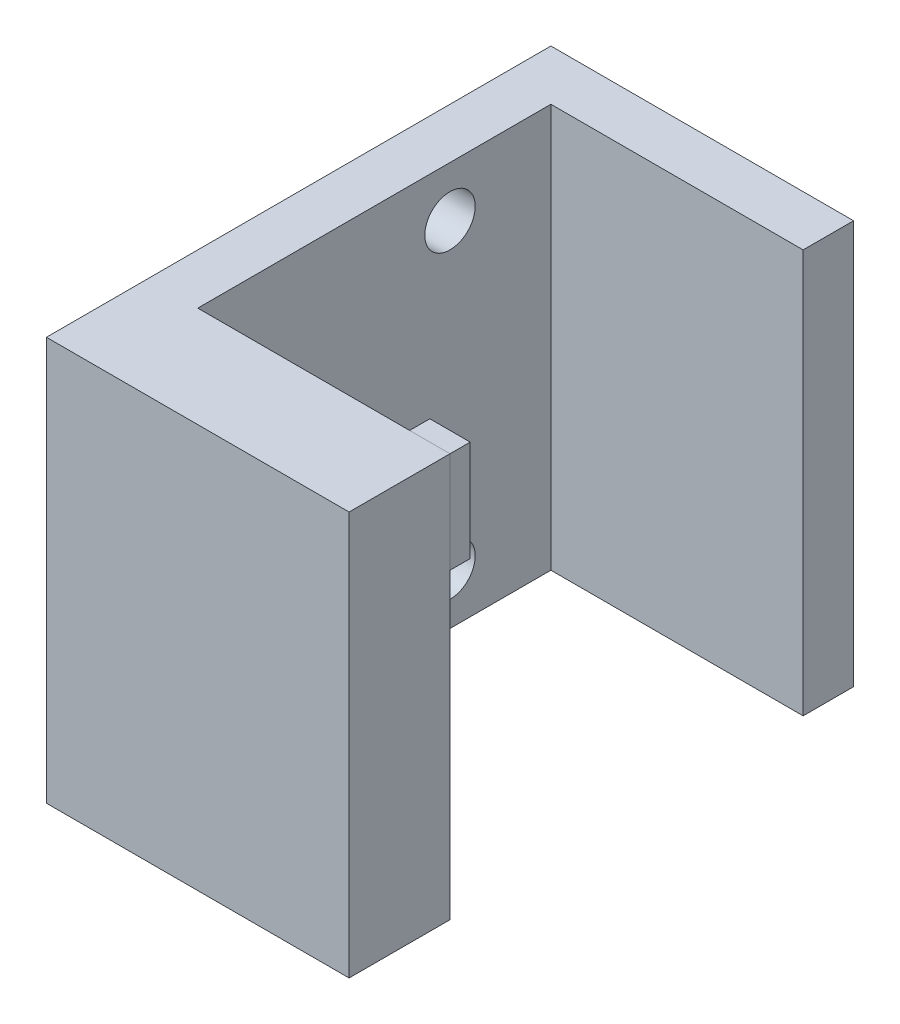
ISO-10303-21;
HEADER;
FILE_DESCRIPTION(('STEP AP214'),'2;1');
FILE_NAME('part.step','',(''),(''),'','','');
FILE_SCHEMA(('AUTOMOTIVE_DESIGN { 1 0 10303 214 1 1 1 1 }'));
ENDSEC;
DATA;
#1=APPLICATION_CONTEXT('core data for automotive mechanical design processes');
#2=APPLICATION_PROTOCOL_DEFINITION('international standard','automotive_design',2000,#1);
#3=PRODUCT_CONTEXT('',#1,'mechanical');
#4=PRODUCT('Part','Part','',(#3));
#5=PRODUCT_RELATED_PRODUCT_CATEGORY('part','',(#4));
#6=PRODUCT_DEFINITION_FORMATION('','',#4);
#7=PRODUCT_DEFINITION_CONTEXT('part definition',#1,'design');
#8=PRODUCT_DEFINITION('design','',#6,#7);
#9=PRODUCT_DEFINITION_SHAPE('','',#8);
#10=(LENGTH_UNIT() NAMED_UNIT(*) SI_UNIT(.MILLI.,.METRE.));
#11=(NAMED_UNIT(*) PLANE_ANGLE_UNIT() SI_UNIT($,.RADIAN.));
#12=(NAMED_UNIT(*) SI_UNIT($,.STERADIAN.) SOLID_ANGLE_UNIT());
#13=UNCERTAINTY_MEASURE_WITH_UNIT(LENGTH_MEASURE(1.E-05),#10,'distance_accuracy_value','');
#14=(GEOMETRIC_REPRESENTATION_CONTEXT(3) GLOBAL_UNCERTAINTY_ASSIGNED_CONTEXT((#13)) GLOBAL_UNIT_ASSIGNED_CONTEXT((#10,
#11,#12)) REPRESENTATION_CONTEXT('',''));
#15=CARTESIAN_POINT('',(0.,0.,0.));
#16=DIRECTION('',(0.,0.,1.));
#17=DIRECTION('',(1.,0.,0.));
#18=AXIS2_PLACEMENT_3D('',#15,#16,#17);
#19=CARTESIAN_POINT('',(0.,200.,-60.));
#20=DIRECTION('',(-1.,0.,0.));
#21=DIRECTION('',(0.,-1.,0.));
#22=AXIS2_PLACEMENT_3D('',#19,#20,#21);
#23=PLANE('',#22);
#24=DIRECTION('',(0.,-1.,0.));
#25=VECTOR('',#24,1.);
#26=CARTESIAN_POINT('',(0.,200.,-50.));
#27=LINE('',#26,#25);
#28=CARTESIAN_POINT('',(0.,200.,-50.));
#29=VERTEX_POINT('',#28);
#30=CARTESIAN_POINT('',(0.,150.,-50.));
#31=VERTEX_POINT('',#30);
#32=EDGE_CURVE('E105',#29,#31,#27,.T.);
#33=ORIENTED_EDGE('',*,*,#32,.T.);
#34=DIRECTION('',(0.,0.,1.));
#35=VECTOR('',#34,1.);
#36=CARTESIAN_POINT('',(0.,150.,-60.));
#37=LINE('',#36,#35);
#38=CARTESIAN_POINT('',(0.,150.,-60.));
#39=VERTEX_POINT('',#38);
#40=EDGE_CURVE('E12',#39,#31,#37,.T.);
#41=ORIENTED_EDGE('',*,*,#40,.F.);
#42=DIRECTION('',(0.,-1.,0.));
#43=VECTOR('',#42,1.);
#44=CARTESIAN_POINT('',(0.,200.,-60.));
#45=LINE('',#44,#43);
#46=CARTESIAN_POINT('',(0.,200.,-60.));
#47=VERTEX_POINT('',#46);
#48=EDGE_CURVE('E93',#47,#39,#45,.T.);
#49=ORIENTED_EDGE('',*,*,#48,.F.);
#50=DIRECTION('',(0.,0.,1.));
#51=VECTOR('',#50,1.);
#52=CARTESIAN_POINT('',(0.,200.,-60.));
#53=LINE('',#52,#51);
#54=EDGE_CURVE('E101',#47,#29,#53,.T.);
#55=ORIENTED_EDGE('',*,*,#54,.T.);
#56=EDGE_LOOP('',(#33,#41,#49,#55));
#57=FACE_BOUND('',#56,.T.);
#58=ADVANCED_FACE('F42',(#57),#23,.F.);
#59=CARTESIAN_POINT('',(0.,150.,-60.));
#60=DIRECTION('',(0.,1.,0.));
#61=DIRECTION('',(0.,0.,1.));
#62=AXIS2_PLACEMENT_3D('',#59,#60,#61);
#63=PLANE('',#62);
#64=DIRECTION('',(-1.,0.,0.));
#65=VECTOR('',#64,1.);
#66=CARTESIAN_POINT('',(0.,150.,-50.));
#67=LINE('',#66,#65);
#68=CARTESIAN_POINT('',(-20.,150.,-50.));
#69=VERTEX_POINT('',#68);
#70=EDGE_CURVE('E97',#31,#69,#67,.T.);
#71=ORIENTED_EDGE('',*,*,#70,.T.);
#72=DIRECTION('',(0.,0.,1.));
#73=VECTOR('',#72,1.);
#74=CARTESIAN_POINT('',(-20.,150.,-60.));
#75=LINE('',#74,#73);
#76=CARTESIAN_POINT('',(-20.,150.,-60.));
#77=VERTEX_POINT('',#76);
#78=EDGE_CURVE('E50',#77,#69,#75,.T.);
#79=ORIENTED_EDGE('',*,*,#78,.F.);
#80=DIRECTION('',(-1.,0.,0.));
#81=VECTOR('',#80,1.);
#82=CARTESIAN_POINT('',(0.,150.,-60.));
#83=LINE('',#82,#81);
#84=EDGE_CURVE('E88',#39,#77,#83,.T.);
#85=ORIENTED_EDGE('',*,*,#84,.F.);
#86=ORIENTED_EDGE('',*,*,#40,.T.);
#87=EDGE_LOOP('',(#71,#79,#85,#86));
#88=FACE_BOUND('',#87,.T.);
#89=ADVANCED_FACE('F96',(#88),#63,.F.);
#90=CARTESIAN_POINT('',(-20.,200.,-60.));
#91=DIRECTION('',(1.,0.,0.));
#92=DIRECTION('',(0.,0.,-1.));
#93=AXIS2_PLACEMENT_3D('',#90,#91,#92);
#94=PLANE('',#93);
#95=DIRECTION('',(0.,1.,0.));
#96=VECTOR('',#95,1.);
#97=CARTESIAN_POINT('',(-20.,200.,-50.));
#98=LINE('',#97,#96);
#99=CARTESIAN_POINT('',(-20.,200.,-50.));
#100=VERTEX_POINT('',#99);
#101=EDGE_CURVE('E75',#69,#100,#98,.T.);
#102=ORIENTED_EDGE('',*,*,#101,.T.);
#103=DIRECTION('',(0.,0.,1.));
#104=VECTOR('',#103,1.);
#105=CARTESIAN_POINT('',(-20.,200.,-60.));
#106=LINE('',#105,#104);
#107=CARTESIAN_POINT('',(-20.,200.,-60.));
#108=VERTEX_POINT('',#107);
#109=EDGE_CURVE('E98',#108,#100,#106,.T.);
#110=ORIENTED_EDGE('',*,*,#109,.F.);
#111=DIRECTION('',(0.,1.,0.));
#112=VECTOR('',#111,1.);
#113=CARTESIAN_POINT('',(-20.,200.,-60.));
#114=LINE('',#113,#112);
#115=EDGE_CURVE('E91',#77,#108,#114,.T.);
#116=ORIENTED_EDGE('',*,*,#115,.F.);
#117=ORIENTED_EDGE('',*,*,#78,.T.);
#118=EDGE_LOOP('',(#102,#110,#116,#117));
#119=FACE_BOUND('',#118,.T.);
#120=ADVANCED_FACE('F99',(#119),#94,.F.);
#121=CARTESIAN_POINT('',(0.,200.,-60.));
#122=DIRECTION('',(0.,-1.,0.));
#123=DIRECTION('',(0.,0.,-1.));
#124=AXIS2_PLACEMENT_3D('',#121,#122,#123);
#125=PLANE('',#124);
#126=DIRECTION('',(1.,0.,0.));
#127=VECTOR('',#126,1.);
#128=CARTESIAN_POINT('',(0.,200.,-50.));
#129=LINE('',#128,#127);
#130=EDGE_CURVE('E81',#100,#29,#129,.T.);
#131=ORIENTED_EDGE('',*,*,#130,.T.);
#132=ORIENTED_EDGE('',*,*,#54,.F.);
#133=DIRECTION('',(1.,0.,0.));
#134=VECTOR('',#133,1.);
#135=CARTESIAN_POINT('',(0.,200.,-60.));
#136=LINE('',#135,#134);
#137=EDGE_CURVE('E58',#108,#47,#136,.T.);
#138=ORIENTED_EDGE('',*,*,#137,.F.);
#139=ORIENTED_EDGE('',*,*,#109,.T.);
#140=EDGE_LOOP('',(#131,#132,#138,#139));
#141=FACE_BOUND('',#140,.T.);
#142=ADVANCED_FACE('F112',(#141),#125,.F.);
#143=CARTESIAN_POINT('',(0.,0.,-60.));
#144=DIRECTION('',(0.,0.,-1.));
#145=DIRECTION('',(-1.,0.,0.));
#146=AXIS2_PLACEMENT_3D('',#143,#144,#145);
#147=PLANE('',#146);
#148=ORIENTED_EDGE('',*,*,#48,.T.);
#149=ORIENTED_EDGE('',*,*,#84,.T.);
#150=ORIENTED_EDGE('',*,*,#115,.T.);
#151=ORIENTED_EDGE('',*,*,#137,.T.);
#152=EDGE_LOOP('',(#148,#149,#150,#151));
#153=FACE_BOUND('',#152,.T.);
#154=ADVANCED_FACE('F89',(#153),#147,.T.);
#155=CARTESIAN_POINT('',(0.,0.,-50.));
#156=DIRECTION('',(0.,0.,-1.));
#157=DIRECTION('',(-1.,0.,0.));
#158=AXIS2_PLACEMENT_3D('',#155,#156,#157);
#159=PLANE('',#158);
#160=ORIENTED_EDGE('',*,*,#32,.F.);
#161=ORIENTED_EDGE('',*,*,#130,.F.);
#162=ORIENTED_EDGE('',*,*,#101,.F.);
#163=ORIENTED_EDGE('',*,*,#70,.F.);
#164=EDGE_LOOP('',(#160,#161,#162,#163));
#165=FACE_BOUND('',#164,.T.);
#166=ADVANCED_FACE('F115',(#165),#159,.F.);
#167=CLOSED_SHELL('',(#58,#89,#120,#142,#154,#166));
#168=MANIFOLD_SOLID_BREP('B2',#167);
#169=CARTESIAN_POINT('',(-150.,200.,0.));
#170=DIRECTION('',(1.,0.,0.));
#171=DIRECTION('',(0.,0.,-1.));
#172=AXIS2_PLACEMENT_3D('',#169,#170,#171);
#173=PLANE('',#172);
#174=CARTESIAN_POINT('',(-150.,175.,-175.));
#175=DIRECTION('',(-1.,0.,0.));
#176=DIRECTION('',(0.,0.,1.));
#177=AXIS2_PLACEMENT_3D('',#174,#175,#176);
#178=CIRCLE('',#177,12.5);
#179=CARTESIAN_POINT('',(-150.,175.,-162.5));
#180=VERTEX_POINT('',#179);
#181=EDGE_CURVE('E318',#180,#180,#178,.T.);
#182=ORIENTED_EDGE('',*,*,#181,.F.);
#183=EDGE_LOOP('',(#182));
#184=FACE_BOUND('',#183,.T.);
#185=DIRECTION('',(0.,0.,1.));
#186=VECTOR('',#185,1.);
#187=CARTESIAN_POINT('',(-150.,0.,0.));
#188=LINE('',#187,#186);
#189=CARTESIAN_POINT('',(-150.,0.,-250.));
#190=VERTEX_POINT('',#189);
#191=CARTESIAN_POINT('',(-150.,0.,0.));
#192=VERTEX_POINT('',#191);
#193=EDGE_CURVE('E211',#190,#192,#188,.T.);
#194=ORIENTED_EDGE('',*,*,#193,.T.);
#195=DIRECTION('',(0.,-1.,0.));
#196=VECTOR('',#195,1.);
#197=CARTESIAN_POINT('',(-150.,200.,0.));
#198=LINE('',#197,#196);
#199=CARTESIAN_POINT('',(-150.,200.,0.));
#200=VERTEX_POINT('',#199);
#201=EDGE_CURVE('E254',#200,#192,#198,.T.);
#202=ORIENTED_EDGE('',*,*,#201,.F.);
#203=DIRECTION('',(0.,0.,1.));
#204=VECTOR('',#203,1.);
#205=CARTESIAN_POINT('',(-150.,200.,0.));
#206=LINE('',#205,#204);
#207=CARTESIAN_POINT('',(-150.,200.,-250.));
#208=VERTEX_POINT('',#207);
#209=EDGE_CURVE('E242',#208,#200,#206,.T.);
#210=ORIENTED_EDGE('',*,*,#209,.F.);
#211=DIRECTION('',(0.,-1.,0.));
#212=VECTOR('',#211,1.);
#213=CARTESIAN_POINT('',(-150.,200.,-250.));
#214=LINE('',#213,#212);
#215=EDGE_CURVE('E249',#208,#190,#214,.T.);
#216=ORIENTED_EDGE('',*,*,#215,.T.);
#217=EDGE_LOOP('',(#194,#202,#210,#216));
#218=FACE_BOUND('',#217,.T.);
#219=CARTESIAN_POINT('',(-150.,25.,-175.));
#220=DIRECTION('',(-1.,0.,0.));
#221=DIRECTION('',(0.,0.,1.));
#222=AXIS2_PLACEMENT_3D('',#219,#220,#221);
#223=CIRCLE('',#222,12.5);
#224=CARTESIAN_POINT('',(-150.,25.,-162.5));
#225=VERTEX_POINT('',#224);
#226=EDGE_CURVE('E312',#225,#225,#223,.T.);
#227=ORIENTED_EDGE('',*,*,#226,.F.);
#228=EDGE_LOOP('',(#227));
#229=FACE_BOUND('',#228,.T.);
#230=ADVANCED_FACE('F165',(#184,#218,#229),#173,.F.);
#231=CARTESIAN_POINT('',(0.,200.,0.));
#232=DIRECTION('',(-1.,0.,0.));
#233=DIRECTION('',(0.,0.,1.));
#234=AXIS2_PLACEMENT_3D('',#231,#232,#233);
#235=PLANE('',#234);
#236=DIRECTION('',(0.,0.,-1.));
#237=VECTOR('',#236,1.);
#238=CARTESIAN_POINT('',(0.,0.,0.));
#239=LINE('',#238,#237);
#240=CARTESIAN_POINT('',(0.,0.,0.));
#241=VERTEX_POINT('',#240);
#242=CARTESIAN_POINT('',(0.,0.,-50.));
#243=VERTEX_POINT('',#242);
#244=EDGE_CURVE('E262',#241,#243,#239,.T.);
#245=ORIENTED_EDGE('',*,*,#244,.T.);
#246=DIRECTION('',(0.,-1.,0.));
#247=VECTOR('',#246,1.);
#248=CARTESIAN_POINT('',(0.,200.,-50.));
#249=LINE('',#248,#247);
#250=CARTESIAN_POINT('',(0.,200.,-50.));
#251=VERTEX_POINT('',#250);
#252=EDGE_CURVE('E40',#251,#243,#249,.T.);
#253=ORIENTED_EDGE('',*,*,#252,.F.);
#254=DIRECTION('',(0.,0.,-1.));
#255=VECTOR('',#254,1.);
#256=CARTESIAN_POINT('',(0.,200.,0.));
#257=LINE('',#256,#255);
#258=CARTESIAN_POINT('',(0.,200.,0.));
#259=VERTEX_POINT('',#258);
#260=EDGE_CURVE('E277',#259,#251,#257,.T.);
#261=ORIENTED_EDGE('',*,*,#260,.F.);
#262=DIRECTION('',(0.,-1.,0.));
#263=VECTOR('',#262,1.);
#264=CARTESIAN_POINT('',(0.,200.,0.));
#265=LINE('',#264,#263);
#266=EDGE_CURVE('E258',#259,#241,#265,.T.);
#267=ORIENTED_EDGE('',*,*,#266,.T.);
#268=EDGE_LOOP('',(#245,#253,#261,#267));
#269=FACE_BOUND('',#268,.T.);
#270=ADVANCED_FACE('F167',(#269),#235,.F.);
#271=CARTESIAN_POINT('',(0.,200.,-50.));
#272=DIRECTION('',(0.,0.,1.));
#273=DIRECTION('',(1.,0.,0.));
#274=AXIS2_PLACEMENT_3D('',#271,#272,#273);
#275=PLANE('',#274);
#276=DIRECTION('',(-1.,0.,0.));
#277=VECTOR('',#276,1.);
#278=CARTESIAN_POINT('',(0.,0.,-50.));
#279=LINE('',#278,#277);
#280=CARTESIAN_POINT('',(-125.,0.,-50.));
#281=VERTEX_POINT('',#280);
#282=EDGE_CURVE('E265',#243,#281,#279,.T.);
#283=ORIENTED_EDGE('',*,*,#282,.T.);
#284=DIRECTION('',(0.,-1.,0.));
#285=VECTOR('',#284,1.);
#286=CARTESIAN_POINT('',(-125.,200.,-50.));
#287=LINE('',#286,#285);
#288=CARTESIAN_POINT('',(-125.,200.,-50.));
#289=VERTEX_POINT('',#288);
#290=EDGE_CURVE('E174',#289,#281,#287,.T.);
#291=ORIENTED_EDGE('',*,*,#290,.F.);
#292=DIRECTION('',(-1.,0.,0.));
#293=VECTOR('',#292,1.);
#294=CARTESIAN_POINT('',(0.,200.,-50.));
#295=LINE('',#294,#293);
#296=EDGE_CURVE('E225',#251,#289,#295,.T.);
#297=ORIENTED_EDGE('',*,*,#296,.F.);
#298=ORIENTED_EDGE('',*,*,#252,.T.);
#299=EDGE_LOOP('',(#283,#291,#297,#298));
#300=FACE_BOUND('',#299,.T.);
#301=ADVANCED_FACE('F330',(#300),#275,.F.);
#302=CARTESIAN_POINT('',(-125.,200.,-50.));
#303=DIRECTION('',(-1.,0.,0.));
#304=DIRECTION('',(0.,0.,1.));
#305=AXIS2_PLACEMENT_3D('',#302,#303,#304);
#306=PLANE('',#305);
#307=CARTESIAN_POINT('',(-125.,175.,-175.));
#308=DIRECTION('',(-1.,0.,0.));
#309=DIRECTION('',(0.,0.,1.));
#310=AXIS2_PLACEMENT_3D('',#307,#308,#309);
#311=CIRCLE('',#310,12.5);
#312=CARTESIAN_POINT('',(-125.,175.,-162.5));
#313=VERTEX_POINT('',#312);
#314=EDGE_CURVE('E315',#313,#313,#311,.T.);
#315=ORIENTED_EDGE('',*,*,#314,.T.);
#316=EDGE_LOOP('',(#315));
#317=FACE_BOUND('',#316,.T.);
#318=CARTESIAN_POINT('',(-125.,25.,-175.));
#319=DIRECTION('',(-1.,0.,0.));
#320=DIRECTION('',(0.,0.,1.));
#321=AXIS2_PLACEMENT_3D('',#318,#319,#320);
#322=CIRCLE('',#321,12.5);
#323=CARTESIAN_POINT('',(-125.,25.,-162.5));
#324=VERTEX_POINT('',#323);
#325=EDGE_CURVE('E266',#324,#324,#322,.T.);
#326=ORIENTED_EDGE('',*,*,#325,.T.);
#327=EDGE_LOOP('',(#326));
#328=FACE_BOUND('',#327,.T.);
#329=DIRECTION('',(0.,0.,-1.));
#330=VECTOR('',#329,1.);
#331=CARTESIAN_POINT('',(-125.,0.,-50.));
#332=LINE('',#331,#330);
#333=CARTESIAN_POINT('',(-125.,0.,-225.));
#334=VERTEX_POINT('',#333);
#335=EDGE_CURVE('E268',#281,#334,#332,.T.);
#336=ORIENTED_EDGE('',*,*,#335,.T.);
#337=DIRECTION('',(0.,-1.,0.));
#338=VECTOR('',#337,1.);
#339=CARTESIAN_POINT('',(-125.,200.,-225.));
#340=LINE('',#339,#338);
#341=CARTESIAN_POINT('',(-125.,200.,-225.));
#342=VERTEX_POINT('',#341);
#343=EDGE_CURVE('E284',#342,#334,#340,.T.);
#344=ORIENTED_EDGE('',*,*,#343,.F.);
#345=DIRECTION('',(0.,0.,-1.));
#346=VECTOR('',#345,1.);
#347=CARTESIAN_POINT('',(-125.,200.,-50.));
#348=LINE('',#347,#346);
#349=EDGE_CURVE('E292',#289,#342,#348,.T.);
#350=ORIENTED_EDGE('',*,*,#349,.F.);
#351=ORIENTED_EDGE('',*,*,#290,.T.);
#352=EDGE_LOOP('',(#336,#344,#350,#351));
#353=FACE_BOUND('',#352,.T.);
#354=ADVANCED_FACE('F290',(#317,#328,#353),#306,.F.);
#355=CARTESIAN_POINT('',(0.,200.,-225.));
#356=DIRECTION('',(0.,0.,-1.));
#357=DIRECTION('',(-1.,0.,0.));
#358=AXIS2_PLACEMENT_3D('',#355,#356,#357);
#359=PLANE('',#358);
#360=DIRECTION('',(1.,0.,0.));
#361=VECTOR('',#360,1.);
#362=CARTESIAN_POINT('',(0.,0.,-225.));
#363=LINE('',#362,#361);
#364=CARTESIAN_POINT('',(0.,0.,-225.));
#365=VERTEX_POINT('',#364);
#366=EDGE_CURVE('E270',#334,#365,#363,.T.);
#367=ORIENTED_EDGE('',*,*,#366,.T.);
#368=DIRECTION('',(0.,-1.,0.));
#369=VECTOR('',#368,1.);
#370=CARTESIAN_POINT('',(0.,200.,-225.));
#371=LINE('',#370,#369);
#372=CARTESIAN_POINT('',(0.,200.,-225.));
#373=VERTEX_POINT('',#372);
#374=EDGE_CURVE('E281',#373,#365,#371,.T.);
#375=ORIENTED_EDGE('',*,*,#374,.F.);
#376=DIRECTION('',(1.,0.,0.));
#377=VECTOR('',#376,1.);
#378=CARTESIAN_POINT('',(0.,200.,-225.));
#379=LINE('',#378,#377);
#380=EDGE_CURVE('E304',#342,#373,#379,.T.);
#381=ORIENTED_EDGE('',*,*,#380,.F.);
#382=ORIENTED_EDGE('',*,*,#343,.T.);
#383=EDGE_LOOP('',(#367,#375,#381,#382));
#384=FACE_BOUND('',#383,.T.);
#385=ADVANCED_FACE('F300',(#384),#359,.F.);
#386=CARTESIAN_POINT('',(0.,200.,-225.));
#387=DIRECTION('',(-1.,0.,0.));
#388=DIRECTION('',(0.,0.,1.));
#389=AXIS2_PLACEMENT_3D('',#386,#387,#388);
#390=PLANE('',#389);
#391=DIRECTION('',(0.,0.,-1.));
#392=VECTOR('',#391,1.);
#393=CARTESIAN_POINT('',(0.,0.,-225.));
#394=LINE('',#393,#392);
#395=CARTESIAN_POINT('',(0.,0.,-250.));
#396=VERTEX_POINT('',#395);
#397=EDGE_CURVE('E272',#365,#396,#394,.T.);
#398=ORIENTED_EDGE('',*,*,#397,.T.);
#399=DIRECTION('',(0.,-1.,0.));
#400=VECTOR('',#399,1.);
#401=CARTESIAN_POINT('',(0.,200.,-250.));
#402=LINE('',#401,#400);
#403=CARTESIAN_POINT('',(0.,200.,-250.));
#404=VERTEX_POINT('',#403);
#405=EDGE_CURVE('E253',#404,#396,#402,.T.);
#406=ORIENTED_EDGE('',*,*,#405,.F.);
#407=DIRECTION('',(0.,0.,-1.));
#408=VECTOR('',#407,1.);
#409=CARTESIAN_POINT('',(0.,200.,-225.));
#410=LINE('',#409,#408);
#411=EDGE_CURVE('E244',#373,#404,#410,.T.);
#412=ORIENTED_EDGE('',*,*,#411,.F.);
#413=ORIENTED_EDGE('',*,*,#374,.T.);
#414=EDGE_LOOP('',(#398,#406,#412,#413));
#415=FACE_BOUND('',#414,.T.);
#416=ADVANCED_FACE('F303',(#415),#390,.F.);
#417=CARTESIAN_POINT('',(0.,200.,-250.));
#418=DIRECTION('',(0.,0.,1.));
#419=DIRECTION('',(1.,0.,0.));
#420=AXIS2_PLACEMENT_3D('',#417,#418,#419);
#421=PLANE('',#420);
#422=DIRECTION('',(-1.,0.,0.));
#423=VECTOR('',#422,1.);
#424=CARTESIAN_POINT('',(0.,0.,-250.));
#425=LINE('',#424,#423);
#426=EDGE_CURVE('E252',#396,#190,#425,.T.);
#427=ORIENTED_EDGE('',*,*,#426,.T.);
#428=ORIENTED_EDGE('',*,*,#215,.F.);
#429=DIRECTION('',(-1.,0.,0.));
#430=VECTOR('',#429,1.);
#431=CARTESIAN_POINT('',(0.,200.,-250.));
#432=LINE('',#431,#430);
#433=EDGE_CURVE('E238',#404,#208,#432,.T.);
#434=ORIENTED_EDGE('',*,*,#433,.F.);
#435=ORIENTED_EDGE('',*,*,#405,.T.);
#436=EDGE_LOOP('',(#427,#428,#434,#435));
#437=FACE_BOUND('',#436,.T.);
#438=ADVANCED_FACE('F250',(#437),#421,.F.);
#439=CARTESIAN_POINT('',(0.,200.,0.));
#440=DIRECTION('',(0.,0.,-1.));
#441=DIRECTION('',(-1.,0.,0.));
#442=AXIS2_PLACEMENT_3D('',#439,#440,#441);
#443=PLANE('',#442);
#444=DIRECTION('',(1.,0.,0.));
#445=VECTOR('',#444,1.);
#446=CARTESIAN_POINT('',(0.,0.,0.));
#447=LINE('',#446,#445);
#448=EDGE_CURVE('E217',#192,#241,#447,.T.);
#449=ORIENTED_EDGE('',*,*,#448,.T.);
#450=ORIENTED_EDGE('',*,*,#266,.F.);
#451=DIRECTION('',(1.,0.,0.));
#452=VECTOR('',#451,1.);
#453=CARTESIAN_POINT('',(0.,200.,0.));
#454=LINE('',#453,#452);
#455=EDGE_CURVE('E182',#200,#259,#454,.T.);
#456=ORIENTED_EDGE('',*,*,#455,.F.);
#457=ORIENTED_EDGE('',*,*,#201,.T.);
#458=EDGE_LOOP('',(#449,#450,#456,#457));
#459=FACE_BOUND('',#458,.T.);
#460=ADVANCED_FACE('F334',(#459),#443,.F.);
#461=CARTESIAN_POINT('',(0.,200.,0.));
#462=DIRECTION('',(0.,1.,0.));
#463=DIRECTION('',(0.,0.,1.));
#464=AXIS2_PLACEMENT_3D('',#461,#462,#463);
#465=PLANE('',#464);
#466=ORIENTED_EDGE('',*,*,#260,.T.);
#467=ORIENTED_EDGE('',*,*,#296,.T.);
#468=ORIENTED_EDGE('',*,*,#349,.T.);
#469=ORIENTED_EDGE('',*,*,#380,.T.);
#470=ORIENTED_EDGE('',*,*,#411,.T.);
#471=ORIENTED_EDGE('',*,*,#433,.T.);
#472=ORIENTED_EDGE('',*,*,#209,.T.);
#473=ORIENTED_EDGE('',*,*,#455,.T.);
#474=EDGE_LOOP('',(#466,#467,#468,#469,#470,#471,#472,#473));
#475=FACE_BOUND('',#474,.T.);
#476=ADVANCED_FACE('F240',(#475),#465,.T.);
#477=CARTESIAN_POINT('',(0.,0.,0.));
#478=DIRECTION('',(0.,1.,0.));
#479=DIRECTION('',(0.,0.,1.));
#480=AXIS2_PLACEMENT_3D('',#477,#478,#479);
#481=PLANE('',#480);
#482=ORIENTED_EDGE('',*,*,#244,.F.);
#483=ORIENTED_EDGE('',*,*,#448,.F.);
#484=ORIENTED_EDGE('',*,*,#193,.F.);
#485=ORIENTED_EDGE('',*,*,#426,.F.);
#486=ORIENTED_EDGE('',*,*,#397,.F.);
#487=ORIENTED_EDGE('',*,*,#366,.F.);
#488=ORIENTED_EDGE('',*,*,#335,.F.);
#489=ORIENTED_EDGE('',*,*,#282,.F.);
#490=EDGE_LOOP('',(#482,#483,#484,#485,#486,#487,#488,#489));
#491=FACE_BOUND('',#490,.T.);
#492=ADVANCED_FACE('F296',(#491),#481,.F.);
#493=CARTESIAN_POINT('',(-150.,25.,-175.));
#494=DIRECTION('',(-1.,0.,0.));
#495=DIRECTION('',(0.,0.,1.));
#496=AXIS2_PLACEMENT_3D('',#493,#494,#495);
#497=CYLINDRICAL_SURFACE('',#496,12.5);
#498=ORIENTED_EDGE('',*,*,#226,.T.);
#499=EDGE_LOOP('',(#498));
#500=FACE_BOUND('',#499,.T.);
#501=ORIENTED_EDGE('',*,*,#325,.F.);
#502=EDGE_LOOP('',(#501));
#503=FACE_BOUND('',#502,.T.);
#504=ADVANCED_FACE('F357',(#500,#503),#497,.F.);
#505=CARTESIAN_POINT('',(-150.,175.,-175.));
#506=DIRECTION('',(-1.,0.,0.));
#507=DIRECTION('',(0.,0.,1.));
#508=AXIS2_PLACEMENT_3D('',#505,#506,#507);
#509=CYLINDRICAL_SURFACE('',#508,12.5);
#510=ORIENTED_EDGE('',*,*,#181,.T.);
#511=EDGE_LOOP('',(#510));
#512=FACE_BOUND('',#511,.T.);
#513=ORIENTED_EDGE('',*,*,#314,.F.);
#514=EDGE_LOOP('',(#513));
#515=FACE_BOUND('',#514,.T.);
#516=ADVANCED_FACE('F322',(#512,#515),#509,.F.);
#517=CLOSED_SHELL('',(#230,#270,#301,#354,#385,#416,#438,#460,#476,#492,#504,#516));
#518=MANIFOLD_SOLID_BREP('B6',#517);
#519=ADVANCED_BREP_SHAPE_REPRESENTATION('',(#18,#168,#518),#14);
#520=SHAPE_DEFINITION_REPRESENTATION(#9,#519);
ENDSEC;
END-ISO-10303-21;
